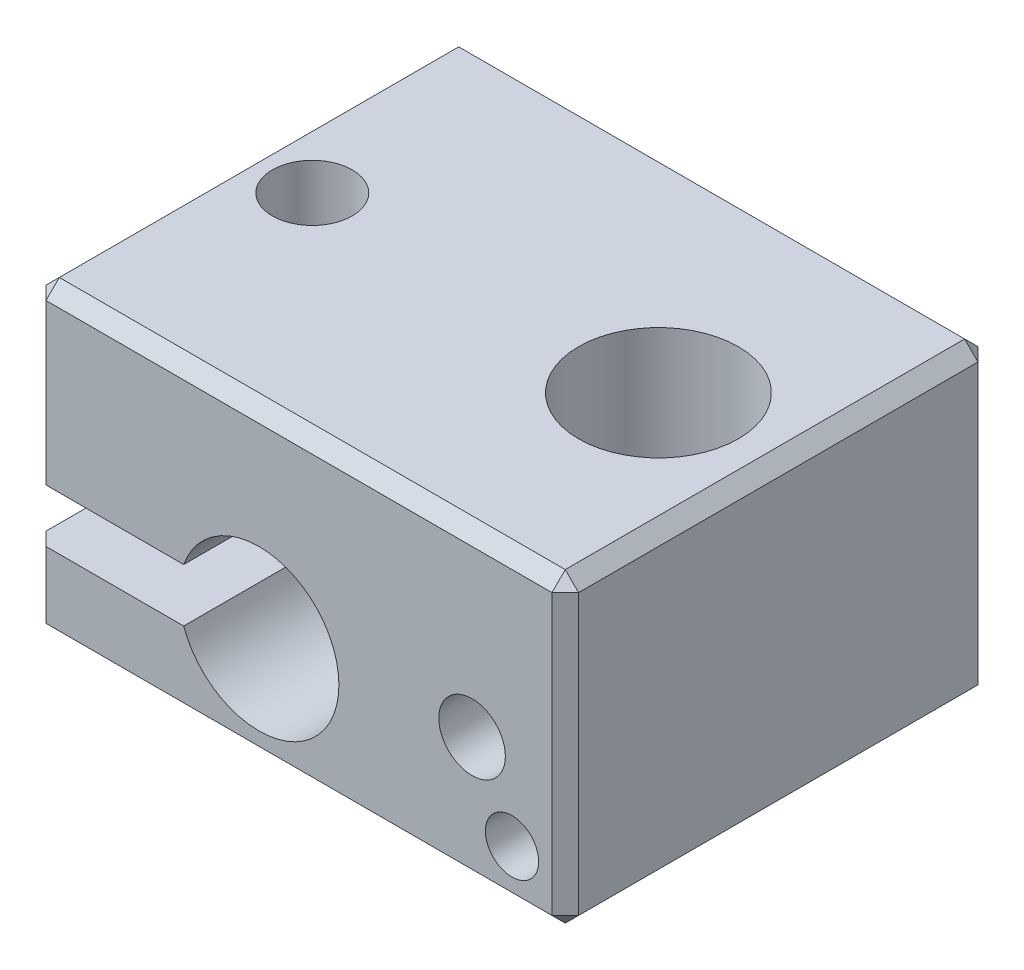
ISO-10303-21;
HEADER;
FILE_DESCRIPTION(('STEP AP214'),'2;1');
FILE_NAME('part.step','',(''),(''),'','','');
FILE_SCHEMA(('AUTOMOTIVE_DESIGN { 1 0 10303 214 1 1 1 1 }'));
ENDSEC;
DATA;
#1=APPLICATION_CONTEXT('core data for automotive mechanical design processes');
#2=APPLICATION_PROTOCOL_DEFINITION('international standard','automotive_design',2000,#1);
#3=PRODUCT_CONTEXT('',#1,'mechanical');
#4=PRODUCT('Part','Part','',(#3));
#5=PRODUCT_RELATED_PRODUCT_CATEGORY('part','',(#4));
#6=PRODUCT_DEFINITION_FORMATION('','',#4);
#7=PRODUCT_DEFINITION_CONTEXT('part definition',#1,'design');
#8=PRODUCT_DEFINITION('design','',#6,#7);
#9=PRODUCT_DEFINITION_SHAPE('','',#8);
#10=(LENGTH_UNIT() NAMED_UNIT(*) SI_UNIT(.MILLI.,.METRE.));
#11=(NAMED_UNIT(*) PLANE_ANGLE_UNIT() SI_UNIT($,.RADIAN.));
#12=(NAMED_UNIT(*) SI_UNIT($,.STERADIAN.) SOLID_ANGLE_UNIT());
#13=UNCERTAINTY_MEASURE_WITH_UNIT(LENGTH_MEASURE(1.E-05),#10,'distance_accuracy_value','');
#14=(GEOMETRIC_REPRESENTATION_CONTEXT(3) GLOBAL_UNCERTAINTY_ASSIGNED_CONTEXT((#13)) GLOBAL_UNIT_ASSIGNED_CONTEXT((#10,
#11,#12)) REPRESENTATION_CONTEXT('',''));
#15=CARTESIAN_POINT('',(0.,0.,0.));
#16=DIRECTION('',(0.,0.,1.));
#17=DIRECTION('',(1.,0.,0.));
#18=AXIS2_PLACEMENT_3D('',#15,#16,#17);
#19=CARTESIAN_POINT('',(-10.,11.5,-8.));
#20=DIRECTION('',(1.,0.,0.));
#21=DIRECTION('',(0.,0.,-1.));
#22=AXIS2_PLACEMENT_3D('',#19,#20,#21);
#23=PLANE('',#22);
#24=DIRECTION('',(0.,0.,1.));
#25=VECTOR('',#24,1.);
#26=CARTESIAN_POINT('',(-10.,5.,-8.));
#27=LINE('',#26,#25);
#28=CARTESIAN_POINT('',(-10.,5.,-7.49999999999999));
#29=VERTEX_POINT('',#28);
#30=CARTESIAN_POINT('',(-10.,5.,7.49999999999999));
#31=VERTEX_POINT('',#30);
#32=EDGE_CURVE('E172',#29,#31,#27,.T.);
#33=ORIENTED_EDGE('',*,*,#32,.T.);
#34=DIRECTION('',(0.,1.,0.));
#35=VECTOR('',#34,1.);
#36=CARTESIAN_POINT('',(-10.,11.5,7.49999999999999));
#37=LINE('',#36,#35);
#38=CARTESIAN_POINT('',(-10.,11.,7.49999999999999));
#39=VERTEX_POINT('',#38);
#40=EDGE_CURVE('E257',#31,#39,#37,.T.);
#41=ORIENTED_EDGE('',*,*,#40,.T.);
#42=DIRECTION('',(0.,0.,-1.));
#43=VECTOR('',#42,1.);
#44=CARTESIAN_POINT('',(-10.,11.,-8.));
#45=LINE('',#44,#43);
#46=CARTESIAN_POINT('',(-10.,11.,-7.49999999999999));
#47=VERTEX_POINT('',#46);
#48=EDGE_CURVE('E255',#39,#47,#45,.T.);
#49=ORIENTED_EDGE('',*,*,#48,.T.);
#50=DIRECTION('',(0.,-1.,0.));
#51=VECTOR('',#50,1.);
#52=CARTESIAN_POINT('',(-10.,11.5,-7.49999999999999));
#53=LINE('',#52,#51);
#54=EDGE_CURVE('E253',#47,#29,#53,.T.);
#55=ORIENTED_EDGE('',*,*,#54,.T.);
#56=EDGE_LOOP('',(#33,#41,#49,#55));
#57=FACE_BOUND('',#56,.T.);
#58=ADVANCED_FACE('F35',(#57),#23,.F.);
#59=CARTESIAN_POINT('',(-7.5,11.5,0.));
#60=DIRECTION('',(0.,-1.,0.));
#61=DIRECTION('',(0.,0.,-1.));
#62=AXIS2_PLACEMENT_3D('',#59,#60,#61);
#63=CYLINDRICAL_SURFACE('',#62,1.5);
#64=CARTESIAN_POINT('',(-7.5,5.,0.));
#65=DIRECTION('',(0.,1.,0.));
#66=DIRECTION('',(0.,0.,1.));
#67=AXIS2_PLACEMENT_3D('',#64,#65,#66);
#68=CIRCLE('',#67,1.5);
#69=CARTESIAN_POINT('',(-7.5,5.,1.5));
#70=VERTEX_POINT('',#69);
#71=EDGE_CURVE('E211',#70,#70,#68,.T.);
#72=ORIENTED_EDGE('',*,*,#71,.F.);
#73=EDGE_LOOP('',(#72));
#74=FACE_BOUND('',#73,.T.);
#75=CARTESIAN_POINT('',(-7.5,11.5,0.));
#76=DIRECTION('',(0.,1.,0.));
#77=DIRECTION('',(0.,0.,1.));
#78=AXIS2_PLACEMENT_3D('',#75,#76,#77);
#79=CIRCLE('',#78,1.5);
#80=CARTESIAN_POINT('',(-7.5,11.5,1.5));
#81=VERTEX_POINT('',#80);
#82=EDGE_CURVE('E204',#81,#81,#79,.T.);
#83=ORIENTED_EDGE('',*,*,#82,.T.);
#84=EDGE_LOOP('',(#83));
#85=FACE_BOUND('',#84,.T.);
#86=ADVANCED_FACE('F481',(#74,#85),#63,.F.);
#87=CARTESIAN_POINT('',(0.,11.5,0.));
#88=DIRECTION('',(0.,-1.,0.));
#89=DIRECTION('',(0.,0.,-1.));
#90=AXIS2_PLACEMENT_3D('',#87,#88,#89);
#91=PLANE('',#90);
#92=DIRECTION('',(1.,0.,0.));
#93=VECTOR('',#92,1.);
#94=CARTESIAN_POINT('',(0.,11.5,7.49999999999999));
#95=LINE('',#94,#93);
#96=CARTESIAN_POINT('',(-9.5,11.5,7.49999999999999));
#97=VERTEX_POINT('',#96);
#98=CARTESIAN_POINT('',(9.5,11.5,7.49999999999999));
#99=VERTEX_POINT('',#98);
#100=EDGE_CURVE('E225',#97,#99,#95,.T.);
#101=ORIENTED_EDGE('',*,*,#100,.T.);
#102=DIRECTION('',(0.,0.,-1.));
#103=VECTOR('',#102,1.);
#104=CARTESIAN_POINT('',(9.5,11.5,0.));
#105=LINE('',#104,#103);
#106=CARTESIAN_POINT('',(9.5,11.5,-7.5));
#107=VERTEX_POINT('',#106);
#108=EDGE_CURVE('E227',#99,#107,#105,.T.);
#109=ORIENTED_EDGE('',*,*,#108,.T.);
#110=DIRECTION('',(-1.,0.,0.));
#111=VECTOR('',#110,1.);
#112=CARTESIAN_POINT('',(0.,11.5,-7.5));
#113=LINE('',#112,#111);
#114=CARTESIAN_POINT('',(-9.5,11.5,-7.49999999999999));
#115=VERTEX_POINT('',#114);
#116=EDGE_CURVE('E215',#107,#115,#113,.T.);
#117=ORIENTED_EDGE('',*,*,#116,.T.);
#118=DIRECTION('',(0.,0.,1.));
#119=VECTOR('',#118,1.);
#120=CARTESIAN_POINT('',(-9.5,11.5,0.));
#121=LINE('',#120,#119);
#122=EDGE_CURVE('E223',#115,#97,#121,.T.);
#123=ORIENTED_EDGE('',*,*,#122,.T.);
#124=EDGE_LOOP('',(#101,#109,#117,#123));
#125=FACE_BOUND('',#124,.T.);
#126=CARTESIAN_POINT('',(5.5,11.5,0.));
#127=DIRECTION('',(0.,1.,0.));
#128=DIRECTION('',(0.,0.,1.));
#129=AXIS2_PLACEMENT_3D('',#126,#127,#128);
#130=CIRCLE('',#129,3.);
#131=CARTESIAN_POINT('',(5.5,11.5,3.));
#132=VERTEX_POINT('',#131);
#133=EDGE_CURVE('E212',#132,#132,#130,.T.);
#134=ORIENTED_EDGE('',*,*,#133,.F.);
#135=EDGE_LOOP('',(#134));
#136=FACE_BOUND('',#135,.T.);
#137=ORIENTED_EDGE('',*,*,#82,.F.);
#138=EDGE_LOOP('',(#137));
#139=FACE_BOUND('',#138,.T.);
#140=ADVANCED_FACE('F395',(#125,#136,#139),#91,.F.);
#141=CARTESIAN_POINT('',(0.,0.,0.));
#142=DIRECTION('',(0.,-1.,0.));
#143=DIRECTION('',(0.,0.,-1.));
#144=AXIS2_PLACEMENT_3D('',#141,#142,#143);
#145=PLANE('',#144);
#146=DIRECTION('',(1.,0.,0.));
#147=VECTOR('',#146,1.);
#148=CARTESIAN_POINT('',(10.,0.,-7.49999999999999));
#149=LINE('',#148,#147);
#150=CARTESIAN_POINT('',(-9.49999999999999,0.,-7.49999999999999));
#151=VERTEX_POINT('',#150);
#152=CARTESIAN_POINT('',(9.49999999999999,0.,-7.49999999999999));
#153=VERTEX_POINT('',#152);
#154=EDGE_CURVE('E44',#151,#153,#149,.T.);
#155=ORIENTED_EDGE('',*,*,#154,.T.);
#156=DIRECTION('',(0.,0.,1.));
#157=VECTOR('',#156,1.);
#158=CARTESIAN_POINT('',(9.49999999999999,0.,8.));
#159=LINE('',#158,#157);
#160=CARTESIAN_POINT('',(9.49999999999999,0.,7.49999999999999));
#161=VERTEX_POINT('',#160);
#162=EDGE_CURVE('E11',#153,#161,#159,.T.);
#163=ORIENTED_EDGE('',*,*,#162,.T.);
#164=DIRECTION('',(-1.,0.,0.));
#165=VECTOR('',#164,1.);
#166=CARTESIAN_POINT('',(-10.,0.,7.49999999999999));
#167=LINE('',#166,#165);
#168=CARTESIAN_POINT('',(-9.49999999999999,0.,7.49999999999999));
#169=VERTEX_POINT('',#168);
#170=EDGE_CURVE('E279',#161,#169,#167,.T.);
#171=ORIENTED_EDGE('',*,*,#170,.T.);
#172=DIRECTION('',(0.,0.,-1.));
#173=VECTOR('',#172,1.);
#174=CARTESIAN_POINT('',(-9.49999999999999,0.,-8.));
#175=LINE('',#174,#173);
#176=EDGE_CURVE('E55',#169,#151,#175,.T.);
#177=ORIENTED_EDGE('',*,*,#176,.T.);
#178=EDGE_LOOP('',(#155,#163,#171,#177));
#179=FACE_BOUND('',#178,.T.);
#180=CARTESIAN_POINT('',(5.5,0.,0.));
#181=DIRECTION('',(0.,1.,0.));
#182=DIRECTION('',(0.,0.,1.));
#183=AXIS2_PLACEMENT_3D('',#180,#181,#182);
#184=CIRCLE('',#183,3.);
#185=CARTESIAN_POINT('',(5.5,0.,3.));
#186=VERTEX_POINT('',#185);
#187=EDGE_CURVE('E207',#186,#186,#184,.T.);
#188=ORIENTED_EDGE('',*,*,#187,.T.);
#189=EDGE_LOOP('',(#188));
#190=FACE_BOUND('',#189,.T.);
#191=CARTESIAN_POINT('',(-7.5,0.,0.));
#192=DIRECTION('',(0.,1.,0.));
#193=DIRECTION('',(0.,0.,1.));
#194=AXIS2_PLACEMENT_3D('',#191,#192,#193);
#195=CIRCLE('',#194,1.5);
#196=CARTESIAN_POINT('',(-7.5,0.,1.5));
#197=VERTEX_POINT('',#196);
#198=EDGE_CURVE('E208',#197,#197,#195,.T.);
#199=ORIENTED_EDGE('',*,*,#198,.T.);
#200=EDGE_LOOP('',(#199));
#201=FACE_BOUND('',#200,.T.);
#202=ADVANCED_FACE('F490',(#179,#190,#201),#145,.T.);
#203=DIRECTION('',(0.,0.,1.));
#204=VECTOR('',#203,1.);
#205=CARTESIAN_POINT('',(-10.,3.,-8.));
#206=LINE('',#205,#204);
#207=CARTESIAN_POINT('',(-10.,3.,-7.49999999999999));
#208=VERTEX_POINT('',#207);
#209=CARTESIAN_POINT('',(-10.,3.,7.49999999999999));
#210=VERTEX_POINT('',#209);
#211=EDGE_CURVE('E183',#208,#210,#206,.T.);
#212=ORIENTED_EDGE('',*,*,#211,.F.);
#213=DIRECTION('',(0.,-1.,0.));
#214=VECTOR('',#213,1.);
#215=CARTESIAN_POINT('',(-10.,11.5,-7.49999999999999));
#216=LINE('',#215,#214);
#217=CARTESIAN_POINT('',(-10.,0.500000000000004,-7.49999999999999));
#218=VERTEX_POINT('',#217);
#219=EDGE_CURVE('E273',#208,#218,#216,.T.);
#220=ORIENTED_EDGE('',*,*,#219,.T.);
#221=DIRECTION('',(0.,0.,1.));
#222=VECTOR('',#221,1.);
#223=CARTESIAN_POINT('',(-10.,0.500000000000004,8.));
#224=LINE('',#223,#222);
#225=CARTESIAN_POINT('',(-10.,0.500000000000004,7.49999999999999));
#226=VERTEX_POINT('',#225);
#227=EDGE_CURVE('E269',#218,#226,#224,.T.);
#228=ORIENTED_EDGE('',*,*,#227,.T.);
#229=DIRECTION('',(0.,1.,0.));
#230=VECTOR('',#229,1.);
#231=CARTESIAN_POINT('',(-10.,11.5,7.49999999999999));
#232=LINE('',#231,#230);
#233=EDGE_CURVE('E271',#226,#210,#232,.T.);
#234=ORIENTED_EDGE('',*,*,#233,.T.);
#235=EDGE_LOOP('',(#212,#220,#228,#234));
#236=FACE_BOUND('',#235,.T.);
#237=ADVANCED_FACE('F371',(#236),#23,.F.);
#238=CARTESIAN_POINT('',(10.,11.5,8.));
#239=DIRECTION('',(0.,0.,-1.));
#240=DIRECTION('',(-1.,0.,0.));
#241=AXIS2_PLACEMENT_3D('',#238,#239,#240);
#242=PLANE('',#241);
#243=CARTESIAN_POINT('',(8.,2.,8.));
#244=DIRECTION('',(0.,0.,1.));
#245=DIRECTION('',(1.,0.,0.));
#246=AXIS2_PLACEMENT_3D('',#243,#244,#245);
#247=CIRCLE('',#246,1.);
#248=CARTESIAN_POINT('',(9.,2.,8.));
#249=VERTEX_POINT('',#248);
#250=EDGE_CURVE('E350',#249,#249,#247,.T.);
#251=ORIENTED_EDGE('',*,*,#250,.F.);
#252=EDGE_LOOP('',(#251));
#253=FACE_BOUND('',#252,.T.);
#254=CARTESIAN_POINT('',(6.5,4.8,8.));
#255=DIRECTION('',(0.,0.,1.));
#256=DIRECTION('',(1.,0.,0.));
#257=AXIS2_PLACEMENT_3D('',#254,#255,#256);
#258=CIRCLE('',#257,1.25);
#259=CARTESIAN_POINT('',(7.75,4.8,8.));
#260=VERTEX_POINT('',#259);
#261=EDGE_CURVE('E358',#260,#260,#258,.T.);
#262=ORIENTED_EDGE('',*,*,#261,.F.);
#263=EDGE_LOOP('',(#262));
#264=FACE_BOUND('',#263,.T.);
#265=DIRECTION('',(-1.,0.,0.));
#266=VECTOR('',#265,1.);
#267=CARTESIAN_POINT('',(10.,11.,8.));
#268=LINE('',#267,#266);
#269=CARTESIAN_POINT('',(9.5,11.,8.));
#270=VERTEX_POINT('',#269);
#271=CARTESIAN_POINT('',(-9.5,11.,8.));
#272=VERTEX_POINT('',#271);
#273=EDGE_CURVE('E245',#270,#272,#268,.T.);
#274=ORIENTED_EDGE('',*,*,#273,.T.);
#275=DIRECTION('',(0.,-1.,0.));
#276=VECTOR('',#275,1.);
#277=CARTESIAN_POINT('',(-9.5,11.5,8.));
#278=LINE('',#277,#276);
#279=CARTESIAN_POINT('',(-9.5,5.,8.));
#280=VERTEX_POINT('',#279);
#281=EDGE_CURVE('E248',#272,#280,#278,.T.);
#282=ORIENTED_EDGE('',*,*,#281,.T.);
#283=DIRECTION('',(-1.,0.,0.));
#284=VECTOR('',#283,1.);
#285=CARTESIAN_POINT('',(-10.,5.,8.));
#286=LINE('',#285,#284);
#287=CARTESIAN_POINT('',(-4.32842712474619,5.,8.));
#288=VERTEX_POINT('',#287);
#289=EDGE_CURVE('E189',#288,#280,#286,.T.);
#290=ORIENTED_EDGE('',*,*,#289,.F.);
#291=CARTESIAN_POINT('',(-1.5,4.,8.));
#292=DIRECTION('',(0.,0.,1.));
#293=DIRECTION('',(1.,0.,0.));
#294=AXIS2_PLACEMENT_3D('',#291,#292,#293);
#295=CIRCLE('',#294,3.);
#296=CARTESIAN_POINT('',(-4.32842712474619,3.,8.));
#297=VERTEX_POINT('',#296);
#298=EDGE_CURVE('E168',#297,#288,#295,.T.);
#299=ORIENTED_EDGE('',*,*,#298,.F.);
#300=DIRECTION('',(1.,0.,0.));
#301=VECTOR('',#300,1.);
#302=CARTESIAN_POINT('',(-10.,3.,8.));
#303=LINE('',#302,#301);
#304=CARTESIAN_POINT('',(-9.5,3.,8.));
#305=VERTEX_POINT('',#304);
#306=EDGE_CURVE('E193',#305,#297,#303,.T.);
#307=ORIENTED_EDGE('',*,*,#306,.F.);
#308=DIRECTION('',(0.,-1.,0.));
#309=VECTOR('',#308,1.);
#310=CARTESIAN_POINT('',(-9.5,11.5,8.));
#311=LINE('',#310,#309);
#312=CARTESIAN_POINT('',(-9.5,0.500000000000004,8.));
#313=VERTEX_POINT('',#312);
#314=EDGE_CURVE('E243',#305,#313,#311,.T.);
#315=ORIENTED_EDGE('',*,*,#314,.T.);
#316=DIRECTION('',(1.,0.,0.));
#317=VECTOR('',#316,1.);
#318=CARTESIAN_POINT('',(10.,0.500000000000004,8.));
#319=LINE('',#318,#317);
#320=CARTESIAN_POINT('',(9.5,0.500000000000004,8.));
#321=VERTEX_POINT('',#320);
#322=EDGE_CURVE('E239',#313,#321,#319,.T.);
#323=ORIENTED_EDGE('',*,*,#322,.T.);
#324=DIRECTION('',(0.,1.,0.));
#325=VECTOR('',#324,1.);
#326=CARTESIAN_POINT('',(9.5,11.5,8.));
#327=LINE('',#326,#325);
#328=EDGE_CURVE('E241',#321,#270,#327,.T.);
#329=ORIENTED_EDGE('',*,*,#328,.T.);
#330=EDGE_LOOP('',(#274,#282,#290,#299,#307,#315,#323,#329));
#331=FACE_BOUND('',#330,.T.);
#332=ADVANCED_FACE('F367',(#253,#264,#331),#242,.F.);
#333=CARTESIAN_POINT('',(10.,11.5,-8.));
#334=DIRECTION('',(-1.,0.,0.));
#335=DIRECTION('',(0.,0.,1.));
#336=AXIS2_PLACEMENT_3D('',#333,#334,#335);
#337=PLANE('',#336);
#338=DIRECTION('',(0.,1.,0.));
#339=VECTOR('',#338,1.);
#340=CARTESIAN_POINT('',(10.,11.5,-7.49999999999999));
#341=LINE('',#340,#339);
#342=CARTESIAN_POINT('',(10.,0.500000000000004,-7.49999999999999));
#343=VERTEX_POINT('',#342);
#344=CARTESIAN_POINT('',(10.,11.,-7.49999999999999));
#345=VERTEX_POINT('',#344);
#346=EDGE_CURVE('E234',#343,#345,#341,.T.);
#347=ORIENTED_EDGE('',*,*,#346,.T.);
#348=DIRECTION('',(0.,0.,1.));
#349=VECTOR('',#348,1.);
#350=CARTESIAN_POINT('',(10.,11.,-8.));
#351=LINE('',#350,#349);
#352=CARTESIAN_POINT('',(10.,11.,7.49999999999999));
#353=VERTEX_POINT('',#352);
#354=EDGE_CURVE('E236',#345,#353,#351,.T.);
#355=ORIENTED_EDGE('',*,*,#354,.T.);
#356=DIRECTION('',(0.,-1.,0.));
#357=VECTOR('',#356,1.);
#358=CARTESIAN_POINT('',(10.,11.5,7.49999999999999));
#359=LINE('',#358,#357);
#360=CARTESIAN_POINT('',(10.,0.500000000000004,7.49999999999999));
#361=VERTEX_POINT('',#360);
#362=EDGE_CURVE('E230',#353,#361,#359,.T.);
#363=ORIENTED_EDGE('',*,*,#362,.T.);
#364=DIRECTION('',(0.,0.,-1.));
#365=VECTOR('',#364,1.);
#366=CARTESIAN_POINT('',(10.,0.500000000000004,-8.));
#367=LINE('',#366,#365);
#368=EDGE_CURVE('E232',#361,#343,#367,.T.);
#369=ORIENTED_EDGE('',*,*,#368,.T.);
#370=EDGE_LOOP('',(#347,#355,#363,#369));
#371=FACE_BOUND('',#370,.T.);
#372=ADVANCED_FACE('F370',(#371),#337,.F.);
#373=CARTESIAN_POINT('',(10.,11.5,-8.));
#374=DIRECTION('',(0.,0.,1.));
#375=DIRECTION('',(1.,0.,0.));
#376=AXIS2_PLACEMENT_3D('',#373,#374,#375);
#377=PLANE('',#376);
#378=DIRECTION('',(-1.,0.,0.));
#379=VECTOR('',#378,1.);
#380=CARTESIAN_POINT('',(-10.,5.,-8.));
#381=LINE('',#380,#379);
#382=CARTESIAN_POINT('',(-4.32842712474619,5.,-8.));
#383=VERTEX_POINT('',#382);
#384=CARTESIAN_POINT('',(-9.49999999999999,5.,-8.));
#385=VERTEX_POINT('',#384);
#386=EDGE_CURVE('E176',#383,#385,#381,.T.);
#387=ORIENTED_EDGE('',*,*,#386,.T.);
#388=DIRECTION('',(0.,1.,0.));
#389=VECTOR('',#388,1.);
#390=CARTESIAN_POINT('',(-9.49999999999999,11.5,-8.));
#391=LINE('',#390,#389);
#392=CARTESIAN_POINT('',(-9.49999999999999,11.,-8.));
#393=VERTEX_POINT('',#392);
#394=EDGE_CURVE('E267',#385,#393,#391,.T.);
#395=ORIENTED_EDGE('',*,*,#394,.T.);
#396=DIRECTION('',(1.,0.,0.));
#397=VECTOR('',#396,1.);
#398=CARTESIAN_POINT('',(10.,11.,-8.));
#399=LINE('',#398,#397);
#400=CARTESIAN_POINT('',(9.5,11.,-8.));
#401=VERTEX_POINT('',#400);
#402=EDGE_CURVE('E265',#393,#401,#399,.T.);
#403=ORIENTED_EDGE('',*,*,#402,.T.);
#404=DIRECTION('',(0.,-1.,0.));
#405=VECTOR('',#404,1.);
#406=CARTESIAN_POINT('',(9.5,11.5,-8.));
#407=LINE('',#406,#405);
#408=CARTESIAN_POINT('',(9.5,0.500000000000004,-8.));
#409=VERTEX_POINT('',#408);
#410=EDGE_CURVE('E261',#401,#409,#407,.T.);
#411=ORIENTED_EDGE('',*,*,#410,.T.);
#412=DIRECTION('',(-1.,0.,0.));
#413=VECTOR('',#412,1.);
#414=CARTESIAN_POINT('',(-10.,0.500000000000004,-8.));
#415=LINE('',#414,#413);
#416=CARTESIAN_POINT('',(-9.49999999999999,0.500000000000004,-8.));
#417=VERTEX_POINT('',#416);
#418=EDGE_CURVE('E259',#409,#417,#415,.T.);
#419=ORIENTED_EDGE('',*,*,#418,.T.);
#420=DIRECTION('',(0.,1.,0.));
#421=VECTOR('',#420,1.);
#422=CARTESIAN_POINT('',(-9.49999999999999,11.5,-8.));
#423=LINE('',#422,#421);
#424=CARTESIAN_POINT('',(-9.49999999999999,3.,-8.));
#425=VERTEX_POINT('',#424);
#426=EDGE_CURVE('E263',#417,#425,#423,.T.);
#427=ORIENTED_EDGE('',*,*,#426,.T.);
#428=DIRECTION('',(1.,0.,0.));
#429=VECTOR('',#428,1.);
#430=CARTESIAN_POINT('',(-10.,3.,-8.));
#431=LINE('',#430,#429);
#432=CARTESIAN_POINT('',(-4.32842712474619,3.,-8.));
#433=VERTEX_POINT('',#432);
#434=EDGE_CURVE('E187',#425,#433,#431,.T.);
#435=ORIENTED_EDGE('',*,*,#434,.T.);
#436=CARTESIAN_POINT('',(-1.5,4.,-8.));
#437=DIRECTION('',(0.,0.,1.));
#438=DIRECTION('',(1.,0.,0.));
#439=AXIS2_PLACEMENT_3D('',#436,#437,#438);
#440=CIRCLE('',#439,3.);
#441=EDGE_CURVE('E165',#433,#383,#440,.T.);
#442=ORIENTED_EDGE('',*,*,#441,.T.);
#443=EDGE_LOOP('',(#387,#395,#403,#411,#419,#427,#435,#442));
#444=FACE_BOUND('',#443,.T.);
#445=ADVANCED_FACE('F185',(#444),#377,.F.);
#446=CARTESIAN_POINT('',(5.5,11.5,0.));
#447=DIRECTION('',(0.,-1.,0.));
#448=DIRECTION('',(0.,0.,-1.));
#449=AXIS2_PLACEMENT_3D('',#446,#447,#448);
#450=CYLINDRICAL_SURFACE('',#449,3.);
#451=ORIENTED_EDGE('',*,*,#133,.T.);
#452=EDGE_LOOP('',(#451));
#453=FACE_BOUND('',#452,.T.);
#454=ORIENTED_EDGE('',*,*,#187,.F.);
#455=EDGE_LOOP('',(#454));
#456=FACE_BOUND('',#455,.T.);
#457=ADVANCED_FACE('F504',(#453,#456),#450,.F.);
#458=CARTESIAN_POINT('',(-7.5,3.,0.));
#459=DIRECTION('',(0.,-1.,0.));
#460=DIRECTION('',(0.,0.,-1.));
#461=AXIS2_PLACEMENT_3D('',#458,#459,#460);
#462=CIRCLE('',#461,1.5);
#463=CARTESIAN_POINT('',(-7.5,3.,-1.5));
#464=VERTEX_POINT('',#463);
#465=EDGE_CURVE('E199',#464,#464,#462,.T.);
#466=ORIENTED_EDGE('',*,*,#465,.F.);
#467=EDGE_LOOP('',(#466));
#468=FACE_BOUND('',#467,.T.);
#469=ORIENTED_EDGE('',*,*,#198,.F.);
#470=EDGE_LOOP('',(#469));
#471=FACE_BOUND('',#470,.T.);
#472=ADVANCED_FACE('F488',(#468,#471),#63,.F.);
#473=CARTESIAN_POINT('',(-10.,5.,-8.));
#474=DIRECTION('',(0.,1.,0.));
#475=DIRECTION('',(0.,0.,1.));
#476=AXIS2_PLACEMENT_3D('',#473,#474,#475);
#477=PLANE('',#476);
#478=ORIENTED_EDGE('',*,*,#71,.T.);
#479=EDGE_LOOP('',(#478));
#480=FACE_BOUND('',#479,.T.);
#481=ORIENTED_EDGE('',*,*,#289,.T.);
#482=DIRECTION('',(0.707106781186545,0.,0.70710678118655));
#483=VECTOR('',#482,1.);
#484=CARTESIAN_POINT('',(-9.5,5.,8.));
#485=LINE('',#484,#483);
#486=EDGE_CURVE('E251',#280,#31,#485,.F.);
#487=ORIENTED_EDGE('',*,*,#486,.T.);
#488=ORIENTED_EDGE('',*,*,#32,.F.);
#489=DIRECTION('',(-0.70710678118655,0.,0.707106781186545));
#490=VECTOR('',#489,1.);
#491=CARTESIAN_POINT('',(-10.,5.,-7.49999999999999));
#492=LINE('',#491,#490);
#493=EDGE_CURVE('E180',#29,#385,#492,.F.);
#494=ORIENTED_EDGE('',*,*,#493,.T.);
#495=ORIENTED_EDGE('',*,*,#386,.F.);
#496=DIRECTION('',(0.,0.,1.));
#497=VECTOR('',#496,1.);
#498=CARTESIAN_POINT('',(-4.32842712474619,5.,-8.));
#499=LINE('',#498,#497);
#500=EDGE_CURVE('E160',#383,#288,#499,.T.);
#501=ORIENTED_EDGE('',*,*,#500,.T.);
#502=EDGE_LOOP('',(#481,#487,#488,#494,#495,#501));
#503=FACE_BOUND('',#502,.T.);
#504=ADVANCED_FACE('F177',(#480,#503),#477,.F.);
#505=CARTESIAN_POINT('',(-1.5,4.,-8.));
#506=DIRECTION('',(0.,0.,1.));
#507=DIRECTION('',(1.,0.,0.));
#508=AXIS2_PLACEMENT_3D('',#505,#506,#507);
#509=CYLINDRICAL_SURFACE('',#508,3.);
#510=ORIENTED_EDGE('',*,*,#298,.T.);
#511=ORIENTED_EDGE('',*,*,#500,.F.);
#512=ORIENTED_EDGE('',*,*,#441,.F.);
#513=DIRECTION('',(0.,0.,1.));
#514=VECTOR('',#513,1.);
#515=CARTESIAN_POINT('',(-4.32842712474619,3.,-8.));
#516=LINE('',#515,#514);
#517=EDGE_CURVE('E173',#433,#297,#516,.T.);
#518=ORIENTED_EDGE('',*,*,#517,.T.);
#519=EDGE_LOOP('',(#510,#511,#512,#518));
#520=FACE_BOUND('',#519,.T.);
#521=ADVANCED_FACE('F162',(#520),#509,.F.);
#522=CARTESIAN_POINT('',(-10.,3.,-8.));
#523=DIRECTION('',(0.,-1.,0.));
#524=DIRECTION('',(0.,0.,-1.));
#525=AXIS2_PLACEMENT_3D('',#522,#523,#524);
#526=PLANE('',#525);
#527=ORIENTED_EDGE('',*,*,#465,.T.);
#528=EDGE_LOOP('',(#527));
#529=FACE_BOUND('',#528,.T.);
#530=ORIENTED_EDGE('',*,*,#434,.F.);
#531=DIRECTION('',(0.70710678118655,0.,-0.707106781186545));
#532=VECTOR('',#531,1.);
#533=CARTESIAN_POINT('',(-10.,3.,-7.49999999999999));
#534=LINE('',#533,#532);
#535=EDGE_CURVE('E277',#425,#208,#534,.F.);
#536=ORIENTED_EDGE('',*,*,#535,.T.);
#537=ORIENTED_EDGE('',*,*,#211,.T.);
#538=DIRECTION('',(-0.707106781186545,0.,-0.70710678118655));
#539=VECTOR('',#538,1.);
#540=CARTESIAN_POINT('',(-9.5,3.,8.));
#541=LINE('',#540,#539);
#542=EDGE_CURVE('E275',#210,#305,#541,.F.);
#543=ORIENTED_EDGE('',*,*,#542,.T.);
#544=ORIENTED_EDGE('',*,*,#306,.T.);
#545=ORIENTED_EDGE('',*,*,#517,.F.);
#546=EDGE_LOOP('',(#530,#536,#537,#543,#544,#545));
#547=FACE_BOUND('',#546,.T.);
#548=ADVANCED_FACE('F456',(#529,#547),#526,.F.);
#549=CARTESIAN_POINT('',(6.5,4.8,5.));
#550=DIRECTION('',(0.,0.,1.));
#551=DIRECTION('',(1.,0.,0.));
#552=AXIS2_PLACEMENT_3D('',#549,#550,#551);
#553=CYLINDRICAL_SURFACE('',#552,1.25);
#554=CARTESIAN_POINT('',(6.5,4.8,5.));
#555=DIRECTION('',(0.,0.,1.));
#556=DIRECTION('',(1.,0.,0.));
#557=AXIS2_PLACEMENT_3D('',#554,#555,#556);
#558=CIRCLE('',#557,1.25);
#559=CARTESIAN_POINT('',(7.75,4.8,5.));
#560=VERTEX_POINT('',#559);
#561=EDGE_CURVE('E195',#560,#560,#558,.T.);
#562=ORIENTED_EDGE('',*,*,#561,.F.);
#563=EDGE_LOOP('',(#562));
#564=FACE_BOUND('',#563,.T.);
#565=ORIENTED_EDGE('',*,*,#261,.T.);
#566=EDGE_LOOP('',(#565));
#567=FACE_BOUND('',#566,.T.);
#568=ADVANCED_FACE('F365',(#564,#567),#553,.F.);
#569=CARTESIAN_POINT('',(6.5,4.8,5.));
#570=DIRECTION('',(0.,0.,1.));
#571=DIRECTION('',(1.,0.,0.));
#572=AXIS2_PLACEMENT_3D('',#569,#570,#571);
#573=PLANE('',#572);
#574=ORIENTED_EDGE('',*,*,#561,.T.);
#575=EDGE_LOOP('',(#574));
#576=FACE_BOUND('',#575,.T.);
#577=ADVANCED_FACE('F554',(#576),#573,.T.);
#578=CARTESIAN_POINT('',(8.,2.,5.));
#579=DIRECTION('',(0.,0.,1.));
#580=DIRECTION('',(1.,0.,0.));
#581=AXIS2_PLACEMENT_3D('',#578,#579,#580);
#582=CYLINDRICAL_SURFACE('',#581,1.);
#583=CARTESIAN_POINT('',(8.,2.,5.));
#584=DIRECTION('',(0.,0.,1.));
#585=DIRECTION('',(1.,0.,0.));
#586=AXIS2_PLACEMENT_3D('',#583,#584,#585);
#587=CIRCLE('',#586,1.);
#588=CARTESIAN_POINT('',(9.,2.,5.));
#589=VERTEX_POINT('',#588);
#590=EDGE_CURVE('E353',#589,#589,#587,.T.);
#591=ORIENTED_EDGE('',*,*,#590,.F.);
#592=EDGE_LOOP('',(#591));
#593=FACE_BOUND('',#592,.T.);
#594=ORIENTED_EDGE('',*,*,#250,.T.);
#595=EDGE_LOOP('',(#594));
#596=FACE_BOUND('',#595,.T.);
#597=ADVANCED_FACE('F562',(#593,#596),#582,.F.);
#598=CARTESIAN_POINT('',(8.,2.,5.));
#599=DIRECTION('',(0.,0.,1.));
#600=DIRECTION('',(1.,0.,0.));
#601=AXIS2_PLACEMENT_3D('',#598,#599,#600);
#602=PLANE('',#601);
#603=ORIENTED_EDGE('',*,*,#590,.T.);
#604=EDGE_LOOP('',(#603));
#605=FACE_BOUND('',#604,.T.);
#606=ADVANCED_FACE('F570',(#605),#602,.T.);
#607=CARTESIAN_POINT('',(-9.5,11.5,8.));
#608=DIRECTION('',(0.70710678118655,0.,-0.707106781186545));
#609=DIRECTION('',(0.,-1.,0.));
#610=AXIS2_PLACEMENT_3D('',#607,#608,#609);
#611=PLANE('',#610);
#612=ORIENTED_EDGE('',*,*,#542,.F.);
#613=ORIENTED_EDGE('',*,*,#233,.F.);
#614=DIRECTION('',(0.707106781186545,0.,0.70710678118655));
#615=VECTOR('',#614,1.);
#616=CARTESIAN_POINT('',(-9.5,0.500000000000004,8.));
#617=LINE('',#616,#615);
#618=EDGE_CURVE('E344',#313,#226,#617,.F.);
#619=ORIENTED_EDGE('',*,*,#618,.F.);
#620=ORIENTED_EDGE('',*,*,#314,.F.);
#621=EDGE_LOOP('',(#612,#613,#619,#620));
#622=FACE_BOUND('',#621,.T.);
#623=ADVANCED_FACE('F37',(#622),#611,.F.);
#624=CARTESIAN_POINT('',(-10.,11.5,-7.49999999999999));
#625=DIRECTION('',(0.707106781186545,0.,0.70710678118655));
#626=DIRECTION('',(0.,-1.,0.));
#627=AXIS2_PLACEMENT_3D('',#624,#625,#626);
#628=PLANE('',#627);
#629=ORIENTED_EDGE('',*,*,#535,.F.);
#630=ORIENTED_EDGE('',*,*,#426,.F.);
#631=DIRECTION('',(-0.70710678118655,0.,0.707106781186545));
#632=VECTOR('',#631,1.);
#633=CARTESIAN_POINT('',(-10.,0.500000000000004,-7.49999999999999));
#634=LINE('',#633,#632);
#635=EDGE_CURVE('E342',#218,#417,#634,.F.);
#636=ORIENTED_EDGE('',*,*,#635,.F.);
#637=ORIENTED_EDGE('',*,*,#219,.F.);
#638=EDGE_LOOP('',(#629,#630,#636,#637));
#639=FACE_BOUND('',#638,.T.);
#640=ADVANCED_FACE('F441',(#639),#628,.F.);
#641=CARTESIAN_POINT('',(-10.,0.500000000000004,-8.));
#642=DIRECTION('',(-0.707106781186545,-0.70710678118655,0.));
#643=DIRECTION('',(0.,0.,-1.));
#644=AXIS2_PLACEMENT_3D('',#641,#642,#643);
#645=PLANE('',#644);
#646=DIRECTION('',(0.70710678118655,-0.707106781186545,0.));
#647=VECTOR('',#646,1.);
#648=CARTESIAN_POINT('',(-9.75,0.250000000000002,7.49999999999999));
#649=LINE('',#648,#647);
#650=EDGE_CURVE('E39',#226,#169,#649,.T.);
#651=ORIENTED_EDGE('',*,*,#650,.F.);
#652=ORIENTED_EDGE('',*,*,#227,.F.);
#653=DIRECTION('',(-0.70710678118655,0.707106781186545,0.));
#654=VECTOR('',#653,1.);
#655=CARTESIAN_POINT('',(-10.,0.500000000000004,-7.49999999999999));
#656=LINE('',#655,#654);
#657=EDGE_CURVE('E339',#151,#218,#656,.T.);
#658=ORIENTED_EDGE('',*,*,#657,.F.);
#659=ORIENTED_EDGE('',*,*,#176,.F.);
#660=EDGE_LOOP('',(#651,#652,#658,#659));
#661=FACE_BOUND('',#660,.T.);
#662=ADVANCED_FACE('F447',(#661),#645,.T.);
#663=CARTESIAN_POINT('',(-9.5,0.500000000000004,8.));
#664=DIRECTION('',(-0.577350269189626,-0.57735026918963,0.577350269189622));
#665=DIRECTION('',(0.70710678118655,-0.707106781186545,0.));
#666=AXIS2_PLACEMENT_3D('',#663,#664,#665);
#667=PLANE('',#666);
#668=ORIENTED_EDGE('',*,*,#618,.T.);
#669=ORIENTED_EDGE('',*,*,#650,.T.);
#670=DIRECTION('',(0.,0.707106781186545,0.70710678118655));
#671=VECTOR('',#670,1.);
#672=CARTESIAN_POINT('',(-9.5,0.500000000000004,8.));
#673=LINE('',#672,#671);
#674=EDGE_CURVE('E336',#313,#169,#673,.F.);
#675=ORIENTED_EDGE('',*,*,#674,.F.);
#676=EDGE_LOOP('',(#668,#669,#675));
#677=FACE_BOUND('',#676,.T.);
#678=ADVANCED_FACE('F594',(#677),#667,.T.);
#679=CARTESIAN_POINT('',(-10.,0.500000000000004,-7.49999999999999));
#680=DIRECTION('',(-0.577350269189622,-0.57735026918963,-0.577350269189626));
#681=DIRECTION('',(0.,0.707106781186545,-0.70710678118655));
#682=AXIS2_PLACEMENT_3D('',#679,#680,#681);
#683=PLANE('',#682);
#684=ORIENTED_EDGE('',*,*,#657,.T.);
#685=ORIENTED_EDGE('',*,*,#635,.T.);
#686=DIRECTION('',(0.,-0.707106781186545,0.70710678118655));
#687=VECTOR('',#686,1.);
#688=CARTESIAN_POINT('',(-9.49999999999999,0.250000000000002,-7.74999999999999));
#689=LINE('',#688,#687);
#690=EDGE_CURVE('E333',#151,#417,#689,.F.);
#691=ORIENTED_EDGE('',*,*,#690,.F.);
#692=EDGE_LOOP('',(#684,#685,#691));
#693=FACE_BOUND('',#692,.T.);
#694=ADVANCED_FACE('F444',(#693),#683,.T.);
#695=CARTESIAN_POINT('',(10.,0.500000000000004,8.));
#696=DIRECTION('',(0.,-0.70710678118655,0.707106781186545));
#697=DIRECTION('',(-1.,0.,0.));
#698=AXIS2_PLACEMENT_3D('',#695,#696,#697);
#699=PLANE('',#698);
#700=ORIENTED_EDGE('',*,*,#674,.T.);
#701=ORIENTED_EDGE('',*,*,#170,.F.);
#702=DIRECTION('',(0.,-0.707106781186545,-0.70710678118655));
#703=VECTOR('',#702,1.);
#704=CARTESIAN_POINT('',(9.49999999999999,0.,7.49999999999999));
#705=LINE('',#704,#703);
#706=EDGE_CURVE('E328',#321,#161,#705,.T.);
#707=ORIENTED_EDGE('',*,*,#706,.F.);
#708=ORIENTED_EDGE('',*,*,#322,.F.);
#709=EDGE_LOOP('',(#700,#701,#707,#708));
#710=FACE_BOUND('',#709,.T.);
#711=ADVANCED_FACE('F462',(#710),#699,.T.);
#712=CARTESIAN_POINT('',(-9.5,11.5,8.));
#713=DIRECTION('',(0.70710678118655,0.,-0.707106781186545));
#714=DIRECTION('',(0.,-1.,0.));
#715=AXIS2_PLACEMENT_3D('',#712,#713,#714);
#716=PLANE('',#715);
#717=ORIENTED_EDGE('',*,*,#486,.F.);
#718=ORIENTED_EDGE('',*,*,#281,.F.);
#719=DIRECTION('',(-0.707106781186545,0.,-0.70710678118655));
#720=VECTOR('',#719,1.);
#721=CARTESIAN_POINT('',(-9.5,11.,8.));
#722=LINE('',#721,#720);
#723=EDGE_CURVE('E325',#39,#272,#722,.F.);
#724=ORIENTED_EDGE('',*,*,#723,.F.);
#725=ORIENTED_EDGE('',*,*,#40,.F.);
#726=EDGE_LOOP('',(#717,#718,#724,#725));
#727=FACE_BOUND('',#726,.T.);
#728=ADVANCED_FACE('F410',(#727),#716,.F.);
#729=CARTESIAN_POINT('',(-9.5,11.5,0.));
#730=DIRECTION('',(0.70710678118655,-0.707106781186545,0.));
#731=DIRECTION('',(0.,0.,1.));
#732=AXIS2_PLACEMENT_3D('',#729,#730,#731);
#733=PLANE('',#732);
#734=DIRECTION('',(-0.707106781186545,-0.70710678118655,0.));
#735=VECTOR('',#734,1.);
#736=CARTESIAN_POINT('',(-10.,11.,-7.49999999999999));
#737=LINE('',#736,#735);
#738=EDGE_CURVE('E319',#47,#115,#737,.F.);
#739=ORIENTED_EDGE('',*,*,#738,.F.);
#740=ORIENTED_EDGE('',*,*,#48,.F.);
#741=DIRECTION('',(0.707106781186545,0.70710678118655,0.));
#742=VECTOR('',#741,1.);
#743=CARTESIAN_POINT('',(-9.75,11.25,7.49999999999999));
#744=LINE('',#743,#742);
#745=EDGE_CURVE('E322',#97,#39,#744,.F.);
#746=ORIENTED_EDGE('',*,*,#745,.F.);
#747=ORIENTED_EDGE('',*,*,#122,.F.);
#748=EDGE_LOOP('',(#739,#740,#746,#747));
#749=FACE_BOUND('',#748,.T.);
#750=ADVANCED_FACE('F403',(#749),#733,.F.);
#751=CARTESIAN_POINT('',(-10.,11.5,-7.49999999999999));
#752=DIRECTION('',(0.707106781186545,0.,0.70710678118655));
#753=DIRECTION('',(0.,-1.,0.));
#754=AXIS2_PLACEMENT_3D('',#751,#752,#753);
#755=PLANE('',#754);
#756=ORIENTED_EDGE('',*,*,#493,.F.);
#757=ORIENTED_EDGE('',*,*,#54,.F.);
#758=DIRECTION('',(0.70710678118655,0.,-0.707106781186545));
#759=VECTOR('',#758,1.);
#760=CARTESIAN_POINT('',(-10.,11.,-7.49999999999999));
#761=LINE('',#760,#759);
#762=EDGE_CURVE('E316',#393,#47,#761,.F.);
#763=ORIENTED_EDGE('',*,*,#762,.F.);
#764=ORIENTED_EDGE('',*,*,#394,.F.);
#765=EDGE_LOOP('',(#756,#757,#763,#764));
#766=FACE_BOUND('',#765,.T.);
#767=ADVANCED_FACE('F415',(#766),#755,.F.);
#768=CARTESIAN_POINT('',(10.,0.500000000000004,-8.));
#769=DIRECTION('',(0.,-0.70710678118655,-0.707106781186545));
#770=DIRECTION('',(1.,0.,0.));
#771=AXIS2_PLACEMENT_3D('',#768,#769,#770);
#772=PLANE('',#771);
#773=ORIENTED_EDGE('',*,*,#690,.T.);
#774=ORIENTED_EDGE('',*,*,#418,.F.);
#775=DIRECTION('',(0.,0.707106781186545,-0.70710678118655));
#776=VECTOR('',#775,1.);
#777=CARTESIAN_POINT('',(9.5,0.500000000000004,-8.));
#778=LINE('',#777,#776);
#779=EDGE_CURVE('E313',#153,#409,#778,.T.);
#780=ORIENTED_EDGE('',*,*,#779,.F.);
#781=ORIENTED_EDGE('',*,*,#154,.F.);
#782=EDGE_LOOP('',(#773,#774,#780,#781));
#783=FACE_BOUND('',#782,.T.);
#784=ADVANCED_FACE('F435',(#783),#772,.T.);
#785=CARTESIAN_POINT('',(10.,0.500000000000004,-8.));
#786=DIRECTION('',(0.707106781186545,-0.70710678118655,0.));
#787=DIRECTION('',(0.,0.,1.));
#788=AXIS2_PLACEMENT_3D('',#785,#786,#787);
#789=PLANE('',#788);
#790=DIRECTION('',(0.70710678118655,0.707106781186545,0.));
#791=VECTOR('',#790,1.);
#792=CARTESIAN_POINT('',(9.49999999999999,0.,7.49999999999999));
#793=LINE('',#792,#791);
#794=EDGE_CURVE('E330',#161,#361,#793,.T.);
#795=ORIENTED_EDGE('',*,*,#794,.F.);
#796=ORIENTED_EDGE('',*,*,#162,.F.);
#797=DIRECTION('',(-0.70710678118655,-0.707106781186545,0.));
#798=VECTOR('',#797,1.);
#799=CARTESIAN_POINT('',(9.75,0.250000000000002,-7.49999999999999));
#800=LINE('',#799,#798);
#801=EDGE_CURVE('E310',#343,#153,#800,.T.);
#802=ORIENTED_EDGE('',*,*,#801,.F.);
#803=ORIENTED_EDGE('',*,*,#368,.F.);
#804=EDGE_LOOP('',(#795,#796,#802,#803));
#805=FACE_BOUND('',#804,.T.);
#806=ADVANCED_FACE('F468',(#805),#789,.T.);
#807=CARTESIAN_POINT('',(9.49999999999999,0.,7.49999999999999));
#808=DIRECTION('',(0.577350269189626,-0.57735026918963,0.577350269189622));
#809=DIRECTION('',(0.70710678118655,0.707106781186545,0.));
#810=AXIS2_PLACEMENT_3D('',#807,#808,#809);
#811=PLANE('',#810);
#812=ORIENTED_EDGE('',*,*,#706,.T.);
#813=ORIENTED_EDGE('',*,*,#794,.T.);
#814=DIRECTION('',(0.707106781186545,0.,-0.70710678118655));
#815=VECTOR('',#814,1.);
#816=CARTESIAN_POINT('',(9.75,0.500000000000004,7.75));
#817=LINE('',#816,#815);
#818=EDGE_CURVE('E307',#321,#361,#817,.T.);
#819=ORIENTED_EDGE('',*,*,#818,.F.);
#820=EDGE_LOOP('',(#812,#813,#819));
#821=FACE_BOUND('',#820,.T.);
#822=ADVANCED_FACE('F465',(#821),#811,.T.);
#823=CARTESIAN_POINT('',(-9.5,11.,8.));
#824=DIRECTION('',(-0.57735026918963,0.577350269189626,0.577350269189622));
#825=DIRECTION('',(-0.707106781186545,-0.70710678118655,0.));
#826=AXIS2_PLACEMENT_3D('',#823,#824,#825);
#827=PLANE('',#826);
#828=ORIENTED_EDGE('',*,*,#745,.T.);
#829=ORIENTED_EDGE('',*,*,#723,.T.);
#830=DIRECTION('',(0.,-0.707106781186545,0.70710678118655));
#831=VECTOR('',#830,1.);
#832=CARTESIAN_POINT('',(-9.5,11.,8.));
#833=LINE('',#832,#831);
#834=EDGE_CURVE('E305',#97,#272,#833,.T.);
#835=ORIENTED_EDGE('',*,*,#834,.F.);
#836=EDGE_LOOP('',(#828,#829,#835));
#837=FACE_BOUND('',#836,.T.);
#838=ADVANCED_FACE('F406',(#837),#827,.T.);
#839=CARTESIAN_POINT('',(-10.,11.,-7.49999999999999));
#840=DIRECTION('',(-0.577350269189626,0.577350269189622,-0.57735026918963));
#841=DIRECTION('',(-0.70710678118655,0.,0.707106781186545));
#842=AXIS2_PLACEMENT_3D('',#839,#840,#841);
#843=PLANE('',#842);
#844=ORIENTED_EDGE('',*,*,#762,.T.);
#845=ORIENTED_EDGE('',*,*,#738,.T.);
#846=DIRECTION('',(0.,0.70710678118655,0.707106781186545));
#847=VECTOR('',#846,1.);
#848=CARTESIAN_POINT('',(-9.49999999999999,11.25,-7.75));
#849=LINE('',#848,#847);
#850=EDGE_CURVE('E302',#393,#115,#849,.T.);
#851=ORIENTED_EDGE('',*,*,#850,.F.);
#852=EDGE_LOOP('',(#844,#845,#851));
#853=FACE_BOUND('',#852,.T.);
#854=ADVANCED_FACE('F418',(#853),#843,.T.);
#855=CARTESIAN_POINT('',(9.5,0.500000000000004,-8.));
#856=DIRECTION('',(0.577350269189626,-0.57735026918963,-0.577350269189622));
#857=DIRECTION('',(0.70710678118655,0.707106781186545,0.));
#858=AXIS2_PLACEMENT_3D('',#855,#856,#857);
#859=PLANE('',#858);
#860=ORIENTED_EDGE('',*,*,#801,.T.);
#861=ORIENTED_EDGE('',*,*,#779,.T.);
#862=DIRECTION('',(-0.707106781186545,0.,-0.70710678118655));
#863=VECTOR('',#862,1.);
#864=CARTESIAN_POINT('',(9.5,0.500000000000004,-8.));
#865=LINE('',#864,#863);
#866=EDGE_CURVE('E299',#343,#409,#865,.T.);
#867=ORIENTED_EDGE('',*,*,#866,.F.);
#868=EDGE_LOOP('',(#860,#861,#867));
#869=FACE_BOUND('',#868,.T.);
#870=ADVANCED_FACE('F431',(#869),#859,.T.);
#871=CARTESIAN_POINT('',(10.,11.5,7.49999999999999));
#872=DIRECTION('',(-0.70710678118655,0.,-0.707106781186545));
#873=DIRECTION('',(0.,-1.,0.));
#874=AXIS2_PLACEMENT_3D('',#871,#872,#873);
#875=PLANE('',#874);
#876=ORIENTED_EDGE('',*,*,#818,.T.);
#877=ORIENTED_EDGE('',*,*,#362,.F.);
#878=DIRECTION('',(-0.707106781186545,0.,0.70710678118655));
#879=VECTOR('',#878,1.);
#880=CARTESIAN_POINT('',(10.,11.,7.49999999999999));
#881=LINE('',#880,#879);
#882=EDGE_CURVE('E296',#270,#353,#881,.F.);
#883=ORIENTED_EDGE('',*,*,#882,.F.);
#884=ORIENTED_EDGE('',*,*,#328,.F.);
#885=EDGE_LOOP('',(#876,#877,#883,#884));
#886=FACE_BOUND('',#885,.T.);
#887=ADVANCED_FACE('F386',(#886),#875,.F.);
#888=CARTESIAN_POINT('',(0.,11.5,7.49999999999999));
#889=DIRECTION('',(0.,-0.70710678118655,-0.707106781186545));
#890=DIRECTION('',(1.,0.,0.));
#891=AXIS2_PLACEMENT_3D('',#888,#889,#890);
#892=PLANE('',#891);
#893=ORIENTED_EDGE('',*,*,#834,.T.);
#894=ORIENTED_EDGE('',*,*,#273,.F.);
#895=DIRECTION('',(0.,0.707106781186545,-0.70710678118655));
#896=VECTOR('',#895,1.);
#897=CARTESIAN_POINT('',(9.5,11.25,7.75));
#898=LINE('',#897,#896);
#899=EDGE_CURVE('E293',#99,#270,#898,.F.);
#900=ORIENTED_EDGE('',*,*,#899,.F.);
#901=ORIENTED_EDGE('',*,*,#100,.F.);
#902=EDGE_LOOP('',(#893,#894,#900,#901));
#903=FACE_BOUND('',#902,.T.);
#904=ADVANCED_FACE('F380',(#903),#892,.F.);
#905=CARTESIAN_POINT('',(0.,11.5,-7.5));
#906=DIRECTION('',(0.,-0.707106781186545,0.70710678118655));
#907=DIRECTION('',(-1.,0.,0.));
#908=AXIS2_PLACEMENT_3D('',#905,#906,#907);
#909=PLANE('',#908);
#910=ORIENTED_EDGE('',*,*,#850,.T.);
#911=ORIENTED_EDGE('',*,*,#116,.F.);
#912=DIRECTION('',(0.,-0.70710678118655,-0.707106781186545));
#913=VECTOR('',#912,1.);
#914=CARTESIAN_POINT('',(9.5,11.5,-7.5));
#915=LINE('',#914,#913);
#916=EDGE_CURVE('E290',#401,#107,#915,.F.);
#917=ORIENTED_EDGE('',*,*,#916,.F.);
#918=ORIENTED_EDGE('',*,*,#402,.F.);
#919=EDGE_LOOP('',(#910,#911,#917,#918));
#920=FACE_BOUND('',#919,.T.);
#921=ADVANCED_FACE('F422',(#920),#909,.F.);
#922=CARTESIAN_POINT('',(9.5,11.5,-8.));
#923=DIRECTION('',(-0.70710678118655,0.,0.707106781186545));
#924=DIRECTION('',(0.,-1.,0.));
#925=AXIS2_PLACEMENT_3D('',#922,#923,#924);
#926=PLANE('',#925);
#927=ORIENTED_EDGE('',*,*,#866,.T.);
#928=ORIENTED_EDGE('',*,*,#410,.F.);
#929=DIRECTION('',(0.707106781186545,0.,0.70710678118655));
#930=VECTOR('',#929,1.);
#931=CARTESIAN_POINT('',(9.75,11.,-7.75));
#932=LINE('',#931,#930);
#933=EDGE_CURVE('E287',#345,#401,#932,.F.);
#934=ORIENTED_EDGE('',*,*,#933,.F.);
#935=ORIENTED_EDGE('',*,*,#346,.F.);
#936=EDGE_LOOP('',(#927,#928,#934,#935));
#937=FACE_BOUND('',#936,.T.);
#938=ADVANCED_FACE('F427',(#937),#926,.F.);
#939=CARTESIAN_POINT('',(10.,11.,7.49999999999999));
#940=DIRECTION('',(0.57735026918963,0.577350269189626,0.577350269189622));
#941=DIRECTION('',(-0.707106781186545,0.70710678118655,0.));
#942=AXIS2_PLACEMENT_3D('',#939,#940,#941);
#943=PLANE('',#942);
#944=ORIENTED_EDGE('',*,*,#899,.T.);
#945=ORIENTED_EDGE('',*,*,#882,.T.);
#946=DIRECTION('',(0.707106781186545,-0.70710678118655,0.));
#947=VECTOR('',#946,1.);
#948=CARTESIAN_POINT('',(10.,11.,7.49999999999999));
#949=LINE('',#948,#947);
#950=EDGE_CURVE('E285',#99,#353,#949,.T.);
#951=ORIENTED_EDGE('',*,*,#950,.F.);
#952=EDGE_LOOP('',(#944,#945,#951));
#953=FACE_BOUND('',#952,.T.);
#954=ADVANCED_FACE('F388',(#953),#943,.T.);
#955=CARTESIAN_POINT('',(9.5,11.5,-7.5));
#956=DIRECTION('',(0.57735026918963,0.577350269189622,-0.577350269189626));
#957=DIRECTION('',(-0.707106781186545,0.,-0.70710678118655));
#958=AXIS2_PLACEMENT_3D('',#955,#956,#957);
#959=PLANE('',#958);
#960=ORIENTED_EDGE('',*,*,#933,.T.);
#961=ORIENTED_EDGE('',*,*,#916,.T.);
#962=DIRECTION('',(-0.707106781186545,0.70710678118655,0.));
#963=VECTOR('',#962,1.);
#964=CARTESIAN_POINT('',(9.5,11.5,-7.5));
#965=LINE('',#964,#963);
#966=EDGE_CURVE('E283',#345,#107,#965,.T.);
#967=ORIENTED_EDGE('',*,*,#966,.F.);
#968=EDGE_LOOP('',(#960,#961,#967));
#969=FACE_BOUND('',#968,.T.);
#970=ADVANCED_FACE('F471',(#969),#959,.T.);
#971=CARTESIAN_POINT('',(9.5,11.5,0.));
#972=DIRECTION('',(-0.70710678118655,-0.707106781186545,0.));
#973=DIRECTION('',(0.,0.,-1.));
#974=AXIS2_PLACEMENT_3D('',#971,#972,#973);
#975=PLANE('',#974);
#976=ORIENTED_EDGE('',*,*,#950,.T.);
#977=ORIENTED_EDGE('',*,*,#354,.F.);
#978=ORIENTED_EDGE('',*,*,#966,.T.);
#979=ORIENTED_EDGE('',*,*,#108,.F.);
#980=EDGE_LOOP('',(#976,#977,#978,#979));
#981=FACE_BOUND('',#980,.T.);
#982=ADVANCED_FACE('F392',(#981),#975,.F.);
#983=CLOSED_SHELL('',(#58,#86,#140,#202,#237,#332,#372,#445,#457,#472,#504,#521,#548,#568,#577,
#597,#606,#623,#640,#662,#678,#694,#711,#728,#750,#767,#784,#806,#822,#838,#854,#870,#887,#904,
#921,#938,#954,#970,#982));
#984=MANIFOLD_SOLID_BREP('B2',#983);
#985=ADVANCED_BREP_SHAPE_REPRESENTATION('',(#18,#984),#14);
#986=SHAPE_DEFINITION_REPRESENTATION(#9,#985);
ENDSEC;
END-ISO-10303-21;
